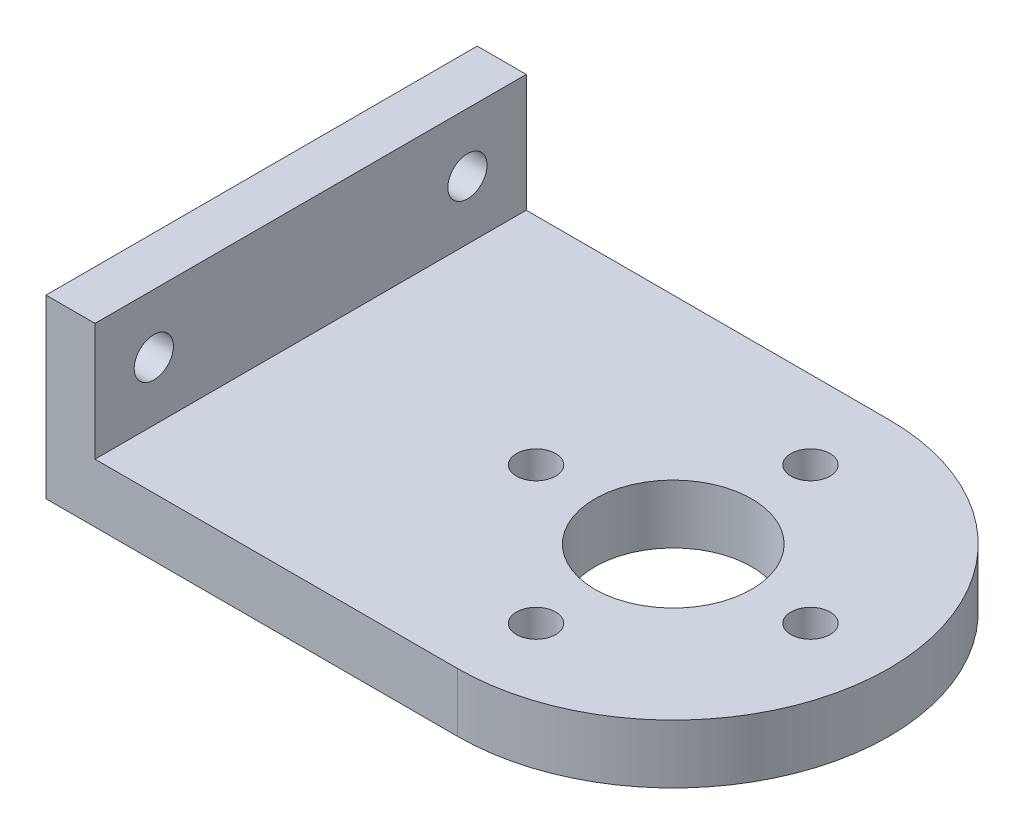
ISO-10303-21;
HEADER;
FILE_DESCRIPTION(('STEP AP214'),'2;1');
FILE_NAME('part.step','',(''),(''),'','','');
FILE_SCHEMA(('AUTOMOTIVE_DESIGN { 1 0 10303 214 1 1 1 1 }'));
ENDSEC;
DATA;
#1=APPLICATION_CONTEXT('core data for automotive mechanical design processes');
#2=APPLICATION_PROTOCOL_DEFINITION('international standard','automotive_design',2000,#1);
#3=PRODUCT_CONTEXT('',#1,'mechanical');
#4=PRODUCT('Part','Part','',(#3));
#5=PRODUCT_RELATED_PRODUCT_CATEGORY('part','',(#4));
#6=PRODUCT_DEFINITION_FORMATION('','',#4);
#7=PRODUCT_DEFINITION_CONTEXT('part definition',#1,'design');
#8=PRODUCT_DEFINITION('design','',#6,#7);
#9=PRODUCT_DEFINITION_SHAPE('','',#8);
#10=(LENGTH_UNIT() NAMED_UNIT(*) SI_UNIT(.MILLI.,.METRE.));
#11=(NAMED_UNIT(*) PLANE_ANGLE_UNIT() SI_UNIT($,.RADIAN.));
#12=(NAMED_UNIT(*) SI_UNIT($,.STERADIAN.) SOLID_ANGLE_UNIT());
#13=UNCERTAINTY_MEASURE_WITH_UNIT(LENGTH_MEASURE(1.E-05),#10,'distance_accuracy_value','');
#14=(GEOMETRIC_REPRESENTATION_CONTEXT(3) GLOBAL_UNCERTAINTY_ASSIGNED_CONTEXT((#13)) GLOBAL_UNIT_ASSIGNED_CONTEXT((#10,
#11,#12)) REPRESENTATION_CONTEXT('',''));
#15=CARTESIAN_POINT('',(0.,0.,0.));
#16=DIRECTION('',(0.,0.,1.));
#17=DIRECTION('',(1.,0.,0.));
#18=AXIS2_PLACEMENT_3D('',#15,#16,#17);
#19=CARTESIAN_POINT('',(-14.,3.,0.));
#20=DIRECTION('',(-1.,0.,0.));
#21=DIRECTION('',(0.,0.,1.));
#22=AXIS2_PLACEMENT_3D('',#19,#20,#21);
#23=PLANE('',#22);
#24=CARTESIAN_POINT('',(-14.,6.,8.));
#25=DIRECTION('',(-1.,0.,0.));
#26=DIRECTION('',(0.,0.,1.));
#27=AXIS2_PLACEMENT_3D('',#24,#25,#26);
#28=CIRCLE('',#27,1.);
#29=CARTESIAN_POINT('',(-14.,6.,9.));
#30=VERTEX_POINT('',#29);
#31=EDGE_CURVE('E168',#30,#30,#28,.T.);
#32=ORIENTED_EDGE('',*,*,#31,.F.);
#33=EDGE_LOOP('',(#32));
#34=FACE_BOUND('',#33,.T.);
#35=CARTESIAN_POINT('',(-14.,6.,-8.));
#36=DIRECTION('',(-1.,0.,0.));
#37=DIRECTION('',(0.,0.,1.));
#38=AXIS2_PLACEMENT_3D('',#35,#36,#37);
#39=CIRCLE('',#38,1.);
#40=CARTESIAN_POINT('',(-14.,6.,-7.));
#41=VERTEX_POINT('',#40);
#42=EDGE_CURVE('E154',#41,#41,#39,.T.);
#43=ORIENTED_EDGE('',*,*,#42,.F.);
#44=EDGE_LOOP('',(#43));
#45=FACE_BOUND('',#44,.T.);
#46=DIRECTION('',(0.,0.,-1.));
#47=VECTOR('',#46,1.);
#48=CARTESIAN_POINT('',(-14.,0.,0.));
#49=LINE('',#48,#47);
#50=CARTESIAN_POINT('',(-14.,0.,11.));
#51=VERTEX_POINT('',#50);
#52=CARTESIAN_POINT('',(-14.,0.,-11.));
#53=VERTEX_POINT('',#52);
#54=EDGE_CURVE('E79',#51,#53,#49,.T.);
#55=ORIENTED_EDGE('',*,*,#54,.F.);
#56=DIRECTION('',(0.,-1.,0.));
#57=VECTOR('',#56,1.);
#58=CARTESIAN_POINT('',(-14.,3.,11.));
#59=LINE('',#58,#57);
#60=CARTESIAN_POINT('',(-14.,9.,11.));
#61=VERTEX_POINT('',#60);
#62=EDGE_CURVE('E11',#61,#51,#59,.T.);
#63=ORIENTED_EDGE('',*,*,#62,.F.);
#64=DIRECTION('',(0.,0.,1.));
#65=VECTOR('',#64,1.);
#66=CARTESIAN_POINT('',(-14.,9.,11.));
#67=LINE('',#66,#65);
#68=CARTESIAN_POINT('',(-14.,9.,-11.));
#69=VERTEX_POINT('',#68);
#70=EDGE_CURVE('E82',#69,#61,#67,.T.);
#71=ORIENTED_EDGE('',*,*,#70,.F.);
#72=DIRECTION('',(0.,-1.,0.));
#73=VECTOR('',#72,1.);
#74=CARTESIAN_POINT('',(-14.,3.,-11.));
#75=LINE('',#74,#73);
#76=EDGE_CURVE('E76',#69,#53,#75,.T.);
#77=ORIENTED_EDGE('',*,*,#76,.T.);
#78=EDGE_LOOP('',(#55,#63,#71,#77));
#79=FACE_BOUND('',#78,.T.);
#80=ADVANCED_FACE('F34',(#34,#45,#79),#23,.T.);
#81=CARTESIAN_POINT('',(0.,3.,11.));
#82=DIRECTION('',(0.,0.,1.));
#83=DIRECTION('',(1.,0.,0.));
#84=AXIS2_PLACEMENT_3D('',#81,#82,#83);
#85=PLANE('',#84);
#86=DIRECTION('',(-1.,0.,0.));
#87=VECTOR('',#86,1.);
#88=CARTESIAN_POINT('',(0.,0.,11.));
#89=LINE('',#88,#87);
#90=CARTESIAN_POINT('',(7.,0.,11.));
#91=VERTEX_POINT('',#90);
#92=EDGE_CURVE('E96',#91,#51,#89,.T.);
#93=ORIENTED_EDGE('',*,*,#92,.F.);
#94=DIRECTION('',(0.,-1.,0.));
#95=VECTOR('',#94,1.);
#96=CARTESIAN_POINT('',(7.,3.,11.));
#97=LINE('',#96,#95);
#98=CARTESIAN_POINT('',(7.,3.,11.));
#99=VERTEX_POINT('',#98);
#100=EDGE_CURVE('E42',#99,#91,#97,.T.);
#101=ORIENTED_EDGE('',*,*,#100,.F.);
#102=DIRECTION('',(-1.,0.,0.));
#103=VECTOR('',#102,1.);
#104=CARTESIAN_POINT('',(0.,3.,11.));
#105=LINE('',#104,#103);
#106=CARTESIAN_POINT('',(-11.5,3.,11.));
#107=VERTEX_POINT('',#106);
#108=EDGE_CURVE('E135',#99,#107,#105,.T.);
#109=ORIENTED_EDGE('',*,*,#108,.T.);
#110=DIRECTION('',(0.,-1.,0.));
#111=VECTOR('',#110,1.);
#112=CARTESIAN_POINT('',(-11.5,9.,11.));
#113=LINE('',#112,#111);
#114=CARTESIAN_POINT('',(-11.5,9.,11.));
#115=VERTEX_POINT('',#114);
#116=EDGE_CURVE('E130',#115,#107,#113,.T.);
#117=ORIENTED_EDGE('',*,*,#116,.F.);
#118=DIRECTION('',(1.,0.,0.));
#119=VECTOR('',#118,1.);
#120=CARTESIAN_POINT('',(-11.5,9.,11.));
#121=LINE('',#120,#119);
#122=EDGE_CURVE('E159',#61,#115,#121,.T.);
#123=ORIENTED_EDGE('',*,*,#122,.F.);
#124=ORIENTED_EDGE('',*,*,#62,.T.);
#125=EDGE_LOOP('',(#93,#101,#109,#117,#123,#124));
#126=FACE_BOUND('',#125,.T.);
#127=ADVANCED_FACE('F116',(#126),#85,.T.);
#128=CARTESIAN_POINT('',(7.,3.,0.));
#129=DIRECTION('',(0.,-1.,0.));
#130=DIRECTION('',(0.,0.,-1.));
#131=AXIS2_PLACEMENT_3D('',#128,#129,#130);
#132=CYLINDRICAL_SURFACE('',#131,11.);
#133=CARTESIAN_POINT('',(7.,0.,0.));
#134=DIRECTION('',(0.,1.,0.));
#135=DIRECTION('',(0.,0.,1.));
#136=AXIS2_PLACEMENT_3D('',#133,#134,#135);
#137=CIRCLE('',#136,11.);
#138=CARTESIAN_POINT('',(7.,0.,-11.));
#139=VERTEX_POINT('',#138);
#140=EDGE_CURVE('E103',#91,#139,#137,.T.);
#141=ORIENTED_EDGE('',*,*,#140,.T.);
#142=DIRECTION('',(0.,-1.,0.));
#143=VECTOR('',#142,1.);
#144=CARTESIAN_POINT('',(7.,3.,-11.));
#145=LINE('',#144,#143);
#146=CARTESIAN_POINT('',(7.,3.,-11.));
#147=VERTEX_POINT('',#146);
#148=EDGE_CURVE('E86',#147,#139,#145,.T.);
#149=ORIENTED_EDGE('',*,*,#148,.F.);
#150=CARTESIAN_POINT('',(7.,3.,0.));
#151=DIRECTION('',(0.,1.,0.));
#152=DIRECTION('',(0.,0.,1.));
#153=AXIS2_PLACEMENT_3D('',#150,#151,#152);
#154=CIRCLE('',#153,11.);
#155=EDGE_CURVE('E114',#99,#147,#154,.T.);
#156=ORIENTED_EDGE('',*,*,#155,.F.);
#157=ORIENTED_EDGE('',*,*,#100,.T.);
#158=EDGE_LOOP('',(#141,#149,#156,#157));
#159=FACE_BOUND('',#158,.T.);
#160=ADVANCED_FACE('F113',(#159),#132,.T.);
#161=CARTESIAN_POINT('',(0.,3.,-11.));
#162=DIRECTION('',(0.,0.,-1.));
#163=DIRECTION('',(-1.,0.,0.));
#164=AXIS2_PLACEMENT_3D('',#161,#162,#163);
#165=PLANE('',#164);
#166=DIRECTION('',(1.,0.,0.));
#167=VECTOR('',#166,1.);
#168=CARTESIAN_POINT('',(0.,0.,-11.));
#169=LINE('',#168,#167);
#170=EDGE_CURVE('E94',#53,#139,#169,.T.);
#171=ORIENTED_EDGE('',*,*,#170,.F.);
#172=ORIENTED_EDGE('',*,*,#76,.F.);
#173=DIRECTION('',(-1.,0.,0.));
#174=VECTOR('',#173,1.);
#175=CARTESIAN_POINT('',(-14.,9.,-11.));
#176=LINE('',#175,#174);
#177=CARTESIAN_POINT('',(-11.5,9.,-11.));
#178=VERTEX_POINT('',#177);
#179=EDGE_CURVE('E152',#178,#69,#176,.T.);
#180=ORIENTED_EDGE('',*,*,#179,.F.);
#181=DIRECTION('',(0.,-1.,0.));
#182=VECTOR('',#181,1.);
#183=CARTESIAN_POINT('',(-11.5,9.,-11.));
#184=LINE('',#183,#182);
#185=CARTESIAN_POINT('',(-11.5,3.,-11.));
#186=VERTEX_POINT('',#185);
#187=EDGE_CURVE('E150',#178,#186,#184,.T.);
#188=ORIENTED_EDGE('',*,*,#187,.T.);
#189=DIRECTION('',(1.,0.,0.));
#190=VECTOR('',#189,1.);
#191=CARTESIAN_POINT('',(0.,3.,-11.));
#192=LINE('',#191,#190);
#193=EDGE_CURVE('E57',#186,#147,#192,.T.);
#194=ORIENTED_EDGE('',*,*,#193,.T.);
#195=ORIENTED_EDGE('',*,*,#148,.T.);
#196=EDGE_LOOP('',(#171,#172,#180,#188,#194,#195));
#197=FACE_BOUND('',#196,.T.);
#198=ADVANCED_FACE('F99',(#197),#165,.T.);
#199=CARTESIAN_POINT('',(7.00000000000007,3.,-7.));
#200=DIRECTION('',(0.,-1.,0.));
#201=DIRECTION('',(0.,0.,-1.));
#202=AXIS2_PLACEMENT_3D('',#199,#200,#201);
#203=CYLINDRICAL_SURFACE('',#202,1.);
#204=CARTESIAN_POINT('',(7.00000000000007,3.,-7.));
#205=DIRECTION('',(0.,1.,0.));
#206=DIRECTION('',(0.,0.,1.));
#207=AXIS2_PLACEMENT_3D('',#204,#205,#206);
#208=CIRCLE('',#207,1.);
#209=CARTESIAN_POINT('',(7.00000000000007,3.,-6.));
#210=VERTEX_POINT('',#209);
#211=EDGE_CURVE('E137',#210,#210,#208,.T.);
#212=ORIENTED_EDGE('',*,*,#211,.T.);
#213=EDGE_LOOP('',(#212));
#214=FACE_BOUND('',#213,.T.);
#215=CARTESIAN_POINT('',(7.00000000000007,0.,-7.));
#216=DIRECTION('',(0.,1.,0.));
#217=DIRECTION('',(0.,0.,1.));
#218=AXIS2_PLACEMENT_3D('',#215,#216,#217);
#219=CIRCLE('',#218,1.);
#220=CARTESIAN_POINT('',(7.00000000000007,0.,-6.));
#221=VERTEX_POINT('',#220);
#222=EDGE_CURVE('E97',#221,#221,#219,.T.);
#223=ORIENTED_EDGE('',*,*,#222,.F.);
#224=EDGE_LOOP('',(#223));
#225=FACE_BOUND('',#224,.T.);
#226=ADVANCED_FACE('F232',(#214,#225),#203,.F.);
#227=CARTESIAN_POINT('',(14.,3.,0.));
#228=DIRECTION('',(0.,-1.,0.));
#229=DIRECTION('',(0.,0.,-1.));
#230=AXIS2_PLACEMENT_3D('',#227,#228,#229);
#231=CYLINDRICAL_SURFACE('',#230,1.);
#232=CARTESIAN_POINT('',(14.,3.,0.));
#233=DIRECTION('',(0.,1.,0.));
#234=DIRECTION('',(0.,0.,1.));
#235=AXIS2_PLACEMENT_3D('',#232,#233,#234);
#236=CIRCLE('',#235,1.);
#237=CARTESIAN_POINT('',(14.,3.,1.));
#238=VERTEX_POINT('',#237);
#239=EDGE_CURVE('E140',#238,#238,#236,.T.);
#240=ORIENTED_EDGE('',*,*,#239,.T.);
#241=EDGE_LOOP('',(#240));
#242=FACE_BOUND('',#241,.T.);
#243=CARTESIAN_POINT('',(14.,0.,0.));
#244=DIRECTION('',(0.,1.,0.));
#245=DIRECTION('',(0.,0.,1.));
#246=AXIS2_PLACEMENT_3D('',#243,#244,#245);
#247=CIRCLE('',#246,1.);
#248=CARTESIAN_POINT('',(14.,0.,1.));
#249=VERTEX_POINT('',#248);
#250=EDGE_CURVE('E121',#249,#249,#247,.T.);
#251=ORIENTED_EDGE('',*,*,#250,.F.);
#252=EDGE_LOOP('',(#251));
#253=FACE_BOUND('',#252,.T.);
#254=ADVANCED_FACE('F235',(#242,#253),#231,.F.);
#255=CARTESIAN_POINT('',(7.,3.,0.));
#256=DIRECTION('',(0.,-1.,0.));
#257=DIRECTION('',(0.,0.,-1.));
#258=AXIS2_PLACEMENT_3D('',#255,#256,#257);
#259=CYLINDRICAL_SURFACE('',#258,4.);
#260=CARTESIAN_POINT('',(7.,3.,0.));
#261=DIRECTION('',(0.,1.,0.));
#262=DIRECTION('',(0.,0.,1.));
#263=AXIS2_PLACEMENT_3D('',#260,#261,#262);
#264=CIRCLE('',#263,4.);
#265=CARTESIAN_POINT('',(7.,3.,4.));
#266=VERTEX_POINT('',#265);
#267=EDGE_CURVE('E143',#266,#266,#264,.T.);
#268=ORIENTED_EDGE('',*,*,#267,.T.);
#269=EDGE_LOOP('',(#268));
#270=FACE_BOUND('',#269,.T.);
#271=CARTESIAN_POINT('',(7.,0.,0.));
#272=DIRECTION('',(0.,1.,0.));
#273=DIRECTION('',(0.,0.,1.));
#274=AXIS2_PLACEMENT_3D('',#271,#272,#273);
#275=CIRCLE('',#274,4.);
#276=CARTESIAN_POINT('',(7.,0.,4.));
#277=VERTEX_POINT('',#276);
#278=EDGE_CURVE('E124',#277,#277,#275,.T.);
#279=ORIENTED_EDGE('',*,*,#278,.F.);
#280=EDGE_LOOP('',(#279));
#281=FACE_BOUND('',#280,.T.);
#282=ADVANCED_FACE('F238',(#270,#281),#259,.F.);
#283=CARTESIAN_POINT('',(0.,3.,0.));
#284=DIRECTION('',(0.,-1.,0.));
#285=DIRECTION('',(0.,0.,-1.));
#286=AXIS2_PLACEMENT_3D('',#283,#284,#285);
#287=CYLINDRICAL_SURFACE('',#286,1.);
#288=CARTESIAN_POINT('',(0.,3.,0.));
#289=DIRECTION('',(0.,1.,0.));
#290=DIRECTION('',(0.,0.,1.));
#291=AXIS2_PLACEMENT_3D('',#288,#289,#290);
#292=CIRCLE('',#291,1.);
#293=CARTESIAN_POINT('',(0.,3.,1.00000000000005));
#294=VERTEX_POINT('',#293);
#295=EDGE_CURVE('E106',#294,#294,#292,.T.);
#296=ORIENTED_EDGE('',*,*,#295,.T.);
#297=EDGE_LOOP('',(#296));
#298=FACE_BOUND('',#297,.T.);
#299=CARTESIAN_POINT('',(0.,0.,0.));
#300=DIRECTION('',(0.,1.,0.));
#301=DIRECTION('',(0.,0.,1.));
#302=AXIS2_PLACEMENT_3D('',#299,#300,#301);
#303=CIRCLE('',#302,1.);
#304=CARTESIAN_POINT('',(0.,0.,1.00000000000005));
#305=VERTEX_POINT('',#304);
#306=EDGE_CURVE('E127',#305,#305,#303,.T.);
#307=ORIENTED_EDGE('',*,*,#306,.F.);
#308=EDGE_LOOP('',(#307));
#309=FACE_BOUND('',#308,.T.);
#310=ADVANCED_FACE('F36',(#298,#309),#287,.F.);
#311=CARTESIAN_POINT('',(6.99999999999998,3.,7.));
#312=DIRECTION('',(0.,-1.,0.));
#313=DIRECTION('',(0.,0.,-1.));
#314=AXIS2_PLACEMENT_3D('',#311,#312,#313);
#315=CYLINDRICAL_SURFACE('',#314,1.);
#316=CARTESIAN_POINT('',(6.99999999999998,3.,7.));
#317=DIRECTION('',(0.,1.,0.));
#318=DIRECTION('',(0.,0.,1.));
#319=AXIS2_PLACEMENT_3D('',#316,#317,#318);
#320=CIRCLE('',#319,1.);
#321=CARTESIAN_POINT('',(6.99999999999998,3.,8.));
#322=VERTEX_POINT('',#321);
#323=EDGE_CURVE('E87',#322,#322,#320,.T.);
#324=ORIENTED_EDGE('',*,*,#323,.T.);
#325=EDGE_LOOP('',(#324));
#326=FACE_BOUND('',#325,.T.);
#327=CARTESIAN_POINT('',(6.99999999999998,0.,7.));
#328=DIRECTION('',(0.,1.,0.));
#329=DIRECTION('',(0.,0.,1.));
#330=AXIS2_PLACEMENT_3D('',#327,#328,#329);
#331=CIRCLE('',#330,1.);
#332=CARTESIAN_POINT('',(6.99999999999998,0.,8.));
#333=VERTEX_POINT('',#332);
#334=EDGE_CURVE('E102',#333,#333,#331,.T.);
#335=ORIENTED_EDGE('',*,*,#334,.F.);
#336=EDGE_LOOP('',(#335));
#337=FACE_BOUND('',#336,.T.);
#338=ADVANCED_FACE('F199',(#326,#337),#315,.F.);
#339=CARTESIAN_POINT('',(0.,3.,0.));
#340=DIRECTION('',(0.,1.,0.));
#341=DIRECTION('',(0.,0.,1.));
#342=AXIS2_PLACEMENT_3D('',#339,#340,#341);
#343=PLANE('',#342);
#344=DIRECTION('',(0.,0.,-1.));
#345=VECTOR('',#344,1.);
#346=CARTESIAN_POINT('',(-11.5,3.,-11.));
#347=LINE('',#346,#345);
#348=EDGE_CURVE('E49',#107,#186,#347,.T.);
#349=ORIENTED_EDGE('',*,*,#348,.F.);
#350=ORIENTED_EDGE('',*,*,#108,.F.);
#351=ORIENTED_EDGE('',*,*,#155,.T.);
#352=ORIENTED_EDGE('',*,*,#193,.F.);
#353=EDGE_LOOP('',(#349,#350,#351,#352));
#354=FACE_BOUND('',#353,.T.);
#355=ORIENTED_EDGE('',*,*,#295,.F.);
#356=EDGE_LOOP('',(#355));
#357=FACE_BOUND('',#356,.T.);
#358=ORIENTED_EDGE('',*,*,#267,.F.);
#359=EDGE_LOOP('',(#358));
#360=FACE_BOUND('',#359,.T.);
#361=ORIENTED_EDGE('',*,*,#239,.F.);
#362=EDGE_LOOP('',(#361));
#363=FACE_BOUND('',#362,.T.);
#364=ORIENTED_EDGE('',*,*,#211,.F.);
#365=EDGE_LOOP('',(#364));
#366=FACE_BOUND('',#365,.T.);
#367=ORIENTED_EDGE('',*,*,#323,.F.);
#368=EDGE_LOOP('',(#367));
#369=FACE_BOUND('',#368,.T.);
#370=ADVANCED_FACE('F196',(#354,#357,#360,#363,#366,#369),#343,.T.);
#371=CARTESIAN_POINT('',(0.,0.,0.));
#372=DIRECTION('',(0.,1.,0.));
#373=DIRECTION('',(0.,0.,1.));
#374=AXIS2_PLACEMENT_3D('',#371,#372,#373);
#375=PLANE('',#374);
#376=ORIENTED_EDGE('',*,*,#306,.T.);
#377=EDGE_LOOP('',(#376));
#378=FACE_BOUND('',#377,.T.);
#379=ORIENTED_EDGE('',*,*,#278,.T.);
#380=EDGE_LOOP('',(#379));
#381=FACE_BOUND('',#380,.T.);
#382=ORIENTED_EDGE('',*,*,#250,.T.);
#383=EDGE_LOOP('',(#382));
#384=FACE_BOUND('',#383,.T.);
#385=ORIENTED_EDGE('',*,*,#222,.T.);
#386=EDGE_LOOP('',(#385));
#387=FACE_BOUND('',#386,.T.);
#388=ORIENTED_EDGE('',*,*,#54,.T.);
#389=ORIENTED_EDGE('',*,*,#170,.T.);
#390=ORIENTED_EDGE('',*,*,#140,.F.);
#391=ORIENTED_EDGE('',*,*,#92,.T.);
#392=EDGE_LOOP('',(#388,#389,#390,#391));
#393=FACE_BOUND('',#392,.T.);
#394=ORIENTED_EDGE('',*,*,#334,.T.);
#395=EDGE_LOOP('',(#394));
#396=FACE_BOUND('',#395,.T.);
#397=ADVANCED_FACE('F91',(#378,#381,#384,#387,#393,#396),#375,.F.);
#398=CARTESIAN_POINT('',(-11.5,9.,-11.));
#399=DIRECTION('',(-1.,0.,0.));
#400=DIRECTION('',(0.,0.,1.));
#401=AXIS2_PLACEMENT_3D('',#398,#399,#400);
#402=PLANE('',#401);
#403=CARTESIAN_POINT('',(-11.5,6.,8.));
#404=DIRECTION('',(1.,0.,0.));
#405=DIRECTION('',(0.,0.,-1.));
#406=AXIS2_PLACEMENT_3D('',#403,#404,#405);
#407=CIRCLE('',#406,1.);
#408=CARTESIAN_POINT('',(-11.5,6.,7.));
#409=VERTEX_POINT('',#408);
#410=EDGE_CURVE('E171',#409,#409,#407,.T.);
#411=ORIENTED_EDGE('',*,*,#410,.F.);
#412=EDGE_LOOP('',(#411));
#413=FACE_BOUND('',#412,.T.);
#414=CARTESIAN_POINT('',(-11.5,6.,-8.));
#415=DIRECTION('',(1.,0.,0.));
#416=DIRECTION('',(0.,0.,-1.));
#417=AXIS2_PLACEMENT_3D('',#414,#415,#416);
#418=CIRCLE('',#417,1.);
#419=CARTESIAN_POINT('',(-11.5,6.,-9.));
#420=VERTEX_POINT('',#419);
#421=EDGE_CURVE('E165',#420,#420,#418,.T.);
#422=ORIENTED_EDGE('',*,*,#421,.F.);
#423=EDGE_LOOP('',(#422));
#424=FACE_BOUND('',#423,.T.);
#425=ORIENTED_EDGE('',*,*,#348,.T.);
#426=ORIENTED_EDGE('',*,*,#187,.F.);
#427=DIRECTION('',(0.,0.,-1.));
#428=VECTOR('',#427,1.);
#429=CARTESIAN_POINT('',(-11.5,9.,-11.));
#430=LINE('',#429,#428);
#431=EDGE_CURVE('E156',#115,#178,#430,.T.);
#432=ORIENTED_EDGE('',*,*,#431,.F.);
#433=ORIENTED_EDGE('',*,*,#116,.T.);
#434=EDGE_LOOP('',(#425,#426,#432,#433));
#435=FACE_BOUND('',#434,.T.);
#436=ADVANCED_FACE('F177',(#413,#424,#435),#402,.F.);
#437=CARTESIAN_POINT('',(0.,9.,0.));
#438=DIRECTION('',(0.,-1.,0.));
#439=DIRECTION('',(0.,0.,-1.));
#440=AXIS2_PLACEMENT_3D('',#437,#438,#439);
#441=PLANE('',#440);
#442=ORIENTED_EDGE('',*,*,#70,.T.);
#443=ORIENTED_EDGE('',*,*,#122,.T.);
#444=ORIENTED_EDGE('',*,*,#431,.T.);
#445=ORIENTED_EDGE('',*,*,#179,.T.);
#446=EDGE_LOOP('',(#442,#443,#444,#445));
#447=FACE_BOUND('',#446,.T.);
#448=ADVANCED_FACE('F180',(#447),#441,.F.);
#449=CARTESIAN_POINT('',(-17.5,6.,-8.));
#450=DIRECTION('',(1.,0.,0.));
#451=DIRECTION('',(0.,0.,-1.));
#452=AXIS2_PLACEMENT_3D('',#449,#450,#451);
#453=CYLINDRICAL_SURFACE('',#452,1.);
#454=ORIENTED_EDGE('',*,*,#42,.T.);
#455=EDGE_LOOP('',(#454));
#456=FACE_BOUND('',#455,.T.);
#457=ORIENTED_EDGE('',*,*,#421,.T.);
#458=EDGE_LOOP('',(#457));
#459=FACE_BOUND('',#458,.T.);
#460=ADVANCED_FACE('F281',(#456,#459),#453,.F.);
#461=CARTESIAN_POINT('',(-17.5,6.,8.));
#462=DIRECTION('',(1.,0.,0.));
#463=DIRECTION('',(0.,0.,-1.));
#464=AXIS2_PLACEMENT_3D('',#461,#462,#463);
#465=CYLINDRICAL_SURFACE('',#464,1.);
#466=ORIENTED_EDGE('',*,*,#31,.T.);
#467=EDGE_LOOP('',(#466));
#468=FACE_BOUND('',#467,.T.);
#469=ORIENTED_EDGE('',*,*,#410,.T.);
#470=EDGE_LOOP('',(#469));
#471=FACE_BOUND('',#470,.T.);
#472=ADVANCED_FACE('F175',(#468,#471),#465,.F.);
#473=CLOSED_SHELL('',(#80,#127,#160,#198,#226,#254,#282,#310,#338,#370,#397,#436,#448,#460,#472));
#474=MANIFOLD_SOLID_BREP('B2',#473);
#475=ADVANCED_BREP_SHAPE_REPRESENTATION('',(#18,#474),#14);
#476=SHAPE_DEFINITION_REPRESENTATION(#9,#475);
ENDSEC;
END-ISO-10303-21;
